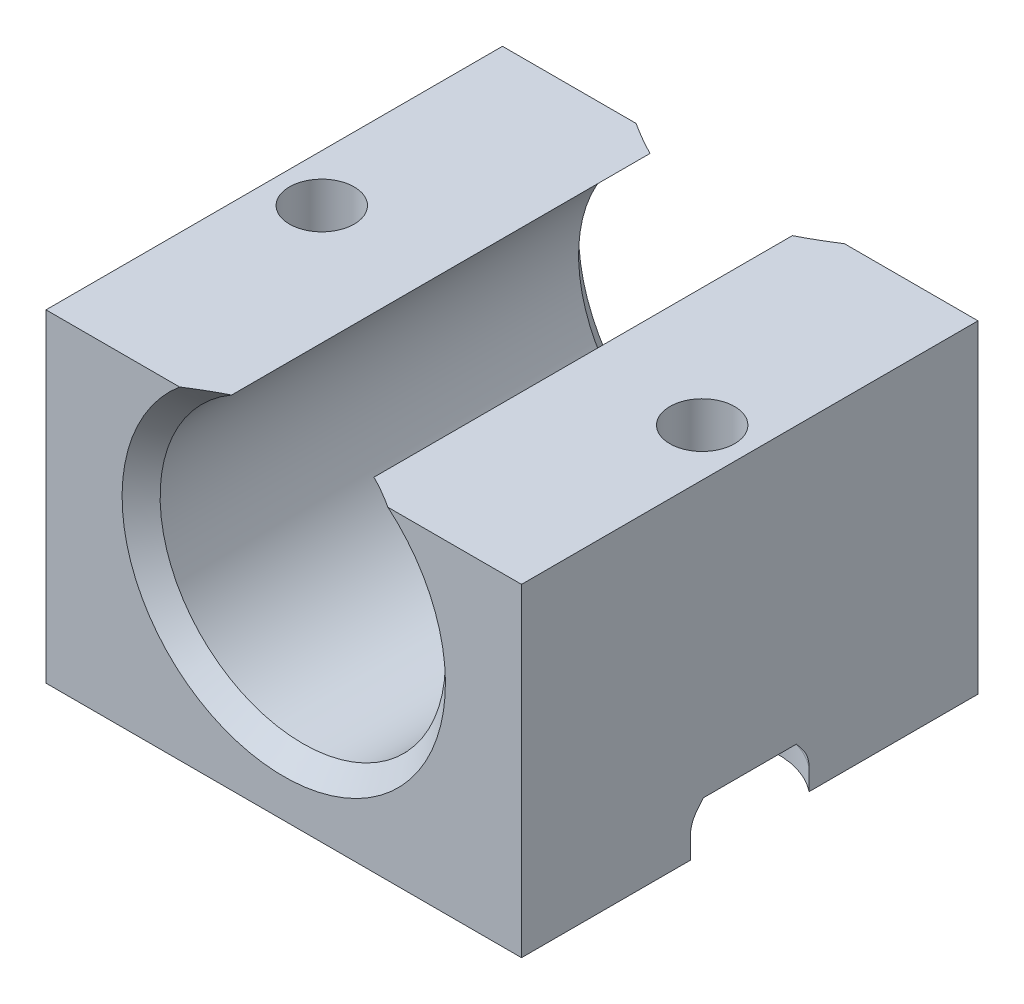
ISO-10303-21;
HEADER;
FILE_DESCRIPTION(('STEP AP214'),'2;1');
FILE_NAME('part.step','',(''),(''),'','','');
FILE_SCHEMA(('AUTOMOTIVE_DESIGN { 1 0 10303 214 1 1 1 1 }'));
ENDSEC;
DATA;
#1=APPLICATION_CONTEXT('core data for automotive mechanical design processes');
#2=APPLICATION_PROTOCOL_DEFINITION('international standard','automotive_design',2000,#1);
#3=PRODUCT_CONTEXT('',#1,'mechanical');
#4=PRODUCT('Part','Part','',(#3));
#5=PRODUCT_RELATED_PRODUCT_CATEGORY('part','',(#4));
#6=PRODUCT_DEFINITION_FORMATION('','',#4);
#7=PRODUCT_DEFINITION_CONTEXT('part definition',#1,'design');
#8=PRODUCT_DEFINITION('design','',#6,#7);
#9=PRODUCT_DEFINITION_SHAPE('','',#8);
#10=(LENGTH_UNIT() NAMED_UNIT(*) SI_UNIT(.MILLI.,.METRE.));
#11=(NAMED_UNIT(*) PLANE_ANGLE_UNIT() SI_UNIT($,.RADIAN.));
#12=(NAMED_UNIT(*) SI_UNIT($,.STERADIAN.) SOLID_ANGLE_UNIT());
#13=UNCERTAINTY_MEASURE_WITH_UNIT(LENGTH_MEASURE(1.E-05),#10,'distance_accuracy_value','');
#14=(GEOMETRIC_REPRESENTATION_CONTEXT(3) GLOBAL_UNCERTAINTY_ASSIGNED_CONTEXT((#13)) GLOBAL_UNIT_ASSIGNED_CONTEXT((#10,
#11,#12)) REPRESENTATION_CONTEXT('',''));
#15=CARTESIAN_POINT('',(0.,0.,0.));
#16=DIRECTION('',(0.,0.,1.));
#17=DIRECTION('',(1.,0.,0.));
#18=AXIS2_PLACEMENT_3D('',#15,#16,#17);
#19=CARTESIAN_POINT('',(22.5,17.,-12.));
#20=DIRECTION('',(0.,1.,0.));
#21=DIRECTION('',(0.,0.,1.));
#22=AXIS2_PLACEMENT_3D('',#19,#20,#21);
#23=CYLINDRICAL_SURFACE('',#22,1.69999999999999);
#24=CARTESIAN_POINT('',(22.5,17.,-12.));
#25=DIRECTION('',(0.,1.,0.));
#26=DIRECTION('',(0.,0.,1.));
#27=AXIS2_PLACEMENT_3D('',#24,#25,#26);
#28=CIRCLE('',#27,1.69999999999999);
#29=CARTESIAN_POINT('',(22.5,17.,-10.3));
#30=VERTEX_POINT('',#29);
#31=EDGE_CURVE('E349',#30,#30,#28,.T.);
#32=ORIENTED_EDGE('',*,*,#31,.T.);
#33=EDGE_LOOP('',(#32));
#34=FACE_BOUND('',#33,.T.);
#35=CARTESIAN_POINT('',(22.5,2.5,-12.));
#36=DIRECTION('',(0.,-1.,0.));
#37=DIRECTION('',(0.,0.,-1.));
#38=AXIS2_PLACEMENT_3D('',#35,#36,#37);
#39=CIRCLE('',#38,1.69999999999999);
#40=CARTESIAN_POINT('',(22.5,2.5,-13.7));
#41=VERTEX_POINT('',#40);
#42=EDGE_CURVE('E173',#41,#41,#39,.F.);
#43=ORIENTED_EDGE('',*,*,#42,.F.);
#44=EDGE_LOOP('',(#43));
#45=FACE_BOUND('',#44,.T.);
#46=ADVANCED_FACE('F35',(#34,#45),#23,.F.);
#47=CARTESIAN_POINT('',(2.5,17.,-12.));
#48=DIRECTION('',(0.,1.,0.));
#49=DIRECTION('',(0.,0.,1.));
#50=AXIS2_PLACEMENT_3D('',#47,#48,#49);
#51=CYLINDRICAL_SURFACE('',#50,1.69999999999999);
#52=CARTESIAN_POINT('',(2.5,17.,-12.));
#53=DIRECTION('',(0.,1.,0.));
#54=DIRECTION('',(0.,0.,1.));
#55=AXIS2_PLACEMENT_3D('',#52,#53,#54);
#56=CIRCLE('',#55,1.69999999999999);
#57=CARTESIAN_POINT('',(2.5,17.,-10.3));
#58=VERTEX_POINT('',#57);
#59=EDGE_CURVE('E183',#58,#58,#56,.T.);
#60=ORIENTED_EDGE('',*,*,#59,.T.);
#61=EDGE_LOOP('',(#60));
#62=FACE_BOUND('',#61,.T.);
#63=CARTESIAN_POINT('',(2.5,2.5,-12.));
#64=DIRECTION('',(0.,-1.,0.));
#65=DIRECTION('',(0.,0.,-1.));
#66=AXIS2_PLACEMENT_3D('',#63,#64,#65);
#67=CIRCLE('',#66,1.69999999999999);
#68=CARTESIAN_POINT('',(2.5,2.5,-13.7));
#69=VERTEX_POINT('',#68);
#70=EDGE_CURVE('E212',#69,#69,#67,.F.);
#71=ORIENTED_EDGE('',*,*,#70,.F.);
#72=EDGE_LOOP('',(#71));
#73=FACE_BOUND('',#72,.T.);
#74=ADVANCED_FACE('F411',(#62,#73),#51,.F.);
#75=CARTESIAN_POINT('',(0.,17.,0.));
#76=DIRECTION('',(0.,0.,-1.));
#77=DIRECTION('',(-1.,0.,0.));
#78=AXIS2_PLACEMENT_3D('',#75,#76,#77);
#79=PLANE('',#78);
#80=DIRECTION('',(1.,0.,0.));
#81=VECTOR('',#80,1.);
#82=CARTESIAN_POINT('',(0.,17.,0.));
#83=LINE('',#82,#81);
#84=CARTESIAN_POINT('',(17.9772255750517,17.,0.));
#85=VERTEX_POINT('',#84);
#86=CARTESIAN_POINT('',(25.,17.,0.));
#87=VERTEX_POINT('',#86);
#88=EDGE_CURVE('E192',#85,#87,#83,.T.);
#89=ORIENTED_EDGE('',*,*,#88,.F.);
#90=CARTESIAN_POINT('',(12.5,10.5,0.));
#91=DIRECTION('',(0.,0.,-1.));
#92=DIRECTION('',(-1.,0.,0.));
#93=AXIS2_PLACEMENT_3D('',#90,#91,#92);
#94=CIRCLE('',#93,8.5);
#95=CARTESIAN_POINT('',(7.02277442494833,17.,0.));
#96=VERTEX_POINT('',#95);
#97=EDGE_CURVE('E265',#85,#96,#94,.T.);
#98=ORIENTED_EDGE('',*,*,#97,.T.);
#99=CARTESIAN_POINT('',(0.,17.,0.));
#100=VERTEX_POINT('',#99);
#101=EDGE_CURVE('E354',#100,#96,#83,.T.);
#102=ORIENTED_EDGE('',*,*,#101,.F.);
#103=DIRECTION('',(0.,-1.,0.));
#104=VECTOR('',#103,1.);
#105=CARTESIAN_POINT('',(0.,17.,0.));
#106=LINE('',#105,#104);
#107=CARTESIAN_POINT('',(0.,0.,0.));
#108=VERTEX_POINT('',#107);
#109=EDGE_CURVE('E193',#100,#108,#106,.T.);
#110=ORIENTED_EDGE('',*,*,#109,.T.);
#111=DIRECTION('',(1.,0.,0.));
#112=VECTOR('',#111,1.);
#113=CARTESIAN_POINT('',(0.,0.,0.));
#114=LINE('',#113,#112);
#115=CARTESIAN_POINT('',(25.,0.,0.));
#116=VERTEX_POINT('',#115);
#117=EDGE_CURVE('E180',#108,#116,#114,.T.);
#118=ORIENTED_EDGE('',*,*,#117,.T.);
#119=DIRECTION('',(0.,-1.,0.));
#120=VECTOR('',#119,1.);
#121=CARTESIAN_POINT('',(25.,17.,0.));
#122=LINE('',#121,#120);
#123=EDGE_CURVE('E202',#87,#116,#122,.T.);
#124=ORIENTED_EDGE('',*,*,#123,.F.);
#125=EDGE_LOOP('',(#89,#98,#102,#110,#118,#124));
#126=FACE_BOUND('',#125,.T.);
#127=ADVANCED_FACE('F375',(#126),#79,.F.);
#128=CARTESIAN_POINT('',(0.,17.,-24.));
#129=DIRECTION('',(0.,0.,1.));
#130=DIRECTION('',(1.,0.,0.));
#131=AXIS2_PLACEMENT_3D('',#128,#129,#130);
#132=PLANE('',#131);
#133=DIRECTION('',(-1.,0.,0.));
#134=VECTOR('',#133,1.);
#135=CARTESIAN_POINT('',(0.,17.,-24.));
#136=LINE('',#135,#134);
#137=CARTESIAN_POINT('',(7.02277442494826,17.,-24.));
#138=VERTEX_POINT('',#137);
#139=CARTESIAN_POINT('',(0.,17.,-24.));
#140=VERTEX_POINT('',#139);
#141=EDGE_CURVE('E359',#138,#140,#136,.T.);
#142=ORIENTED_EDGE('',*,*,#141,.F.);
#143=CARTESIAN_POINT('',(12.5,10.5,-24.));
#144=DIRECTION('',(0.,0.,1.));
#145=DIRECTION('',(1.,0.,0.));
#146=AXIS2_PLACEMENT_3D('',#143,#144,#145);
#147=CIRCLE('',#146,8.50000000000005);
#148=CARTESIAN_POINT('',(17.9772255750517,17.,-24.));
#149=VERTEX_POINT('',#148);
#150=EDGE_CURVE('E260',#138,#149,#147,.T.);
#151=ORIENTED_EDGE('',*,*,#150,.T.);
#152=CARTESIAN_POINT('',(25.,17.,-24.));
#153=VERTEX_POINT('',#152);
#154=EDGE_CURVE('E360',#153,#149,#136,.T.);
#155=ORIENTED_EDGE('',*,*,#154,.F.);
#156=DIRECTION('',(0.,-1.,0.));
#157=VECTOR('',#156,1.);
#158=CARTESIAN_POINT('',(25.,17.,-24.));
#159=LINE('',#158,#157);
#160=CARTESIAN_POINT('',(25.,0.,-24.));
#161=VERTEX_POINT('',#160);
#162=EDGE_CURVE('E200',#153,#161,#159,.T.);
#163=ORIENTED_EDGE('',*,*,#162,.T.);
#164=DIRECTION('',(-1.,0.,0.));
#165=VECTOR('',#164,1.);
#166=CARTESIAN_POINT('',(0.,0.,-24.));
#167=LINE('',#166,#165);
#168=CARTESIAN_POINT('',(0.,0.,-24.));
#169=VERTEX_POINT('',#168);
#170=EDGE_CURVE('E178',#161,#169,#167,.T.);
#171=ORIENTED_EDGE('',*,*,#170,.T.);
#172=DIRECTION('',(0.,-1.,0.));
#173=VECTOR('',#172,1.);
#174=CARTESIAN_POINT('',(0.,17.,-24.));
#175=LINE('',#174,#173);
#176=EDGE_CURVE('E196',#140,#169,#175,.T.);
#177=ORIENTED_EDGE('',*,*,#176,.F.);
#178=EDGE_LOOP('',(#142,#151,#155,#163,#171,#177));
#179=FACE_BOUND('',#178,.T.);
#180=ADVANCED_FACE('F287',(#179),#132,.F.);
#181=CARTESIAN_POINT('',(0.,17.,0.));
#182=DIRECTION('',(0.,1.,0.));
#183=DIRECTION('',(0.,0.,1.));
#184=AXIS2_PLACEMENT_3D('',#181,#182,#183);
#185=PLANE('',#184);
#186=ORIENTED_EDGE('',*,*,#31,.F.);
#187=EDGE_LOOP('',(#186));
#188=FACE_BOUND('',#187,.T.);
#189=ORIENTED_EDGE('',*,*,#154,.T.);
#190=CARTESIAN_POINT('',(17.9772255750517,17.,-24.));
#191=CARTESIAN_POINT('',(17.8368007577669,17.,-23.9095295769993));
#192=CARTESIAN_POINT('',(17.6954537894629,17.,-23.8204671646845));
#193=CARTESIAN_POINT('',(17.4108110965804,17.,-23.6457585728799));
#194=CARTESIAN_POINT('',(17.2675168959503,17.,-23.5601099073508));
#195=CARTESIAN_POINT('',(16.9786465410307,17.,-23.3926810177934));
#196=CARTESIAN_POINT('',(16.8330700586579,17.,-23.3109013568598));
#197=CARTESIAN_POINT('',(16.5393318554942,17.,-23.1518640466128));
#198=CARTESIAN_POINT('',(16.391168293193,17.,-23.0746098043457));
#199=CARTESIAN_POINT('',(16.2416573867739,17.,-23.));
#200=B_SPLINE_CURVE_WITH_KNOTS('',3,(#190,#191,#192,#193,#194,#195,#196,#197,#198,#199),
.UNSPECIFIED.,.F.,.F.,(4,2,2,2,4),(0.,0.50114453227682,1.00191718035662,1.50276248805595,
2.00398014441625),.UNSPECIFIED.);
#201=CARTESIAN_POINT('',(16.2416573867739,17.,-23.));
#202=VERTEX_POINT('',#201);
#203=EDGE_CURVE('E259',#149,#202,#200,.T.);
#204=ORIENTED_EDGE('',*,*,#203,.T.);
#205=DIRECTION('',(0.,0.,-1.));
#206=VECTOR('',#205,1.);
#207=CARTESIAN_POINT('',(16.2416573867739,17.,48.250647664047));
#208=LINE('',#207,#206);
#209=CARTESIAN_POINT('',(16.2416573867739,17.,-1.));
#210=VERTEX_POINT('',#209);
#211=EDGE_CURVE('E208',#202,#210,#208,.F.);
#212=ORIENTED_EDGE('',*,*,#211,.T.);
#213=CARTESIAN_POINT('',(16.2416573867739,17.,-1.));
#214=CARTESIAN_POINT('',(16.391168293193,17.,-0.925390195654238));
#215=CARTESIAN_POINT('',(16.5393318554942,17.,-0.848135953387118));
#216=CARTESIAN_POINT('',(16.8330700586579,17.,-0.689098643140127));
#217=CARTESIAN_POINT('',(16.9786465410307,17.,-0.607318982206532));
#218=CARTESIAN_POINT('',(17.2675168959502,17.,-0.439890092649158));
#219=CARTESIAN_POINT('',(17.4108110965804,17.,-0.354241427120119));
#220=CARTESIAN_POINT('',(17.6954537894628,17.,-0.179532835315521));
#221=CARTESIAN_POINT('',(17.8368007577668,17.,-0.090470423000706));
#222=CARTESIAN_POINT('',(17.9772255750517,17.,0.));
#223=B_SPLINE_CURVE_WITH_KNOTS('',3,(#213,#214,#215,#216,#217,#218,#219,#220,#221,#222),
.UNSPECIFIED.,.F.,.F.,(4,2,2,2,4),(0.,0.501217656360276,1.00206296405958,1.50283561213936,
2.00398014441616),.UNSPECIFIED.);
#224=EDGE_CURVE('E254',#210,#85,#223,.T.);
#225=ORIENTED_EDGE('',*,*,#224,.T.);
#226=ORIENTED_EDGE('',*,*,#88,.T.);
#227=DIRECTION('',(0.,0.,-1.));
#228=VECTOR('',#227,1.);
#229=CARTESIAN_POINT('',(25.,17.,0.));
#230=LINE('',#229,#228);
#231=EDGE_CURVE('E357',#87,#153,#230,.T.);
#232=ORIENTED_EDGE('',*,*,#231,.T.);
#233=EDGE_LOOP('',(#189,#204,#212,#225,#226,#232));
#234=FACE_BOUND('',#233,.T.);
#235=ADVANCED_FACE('F237',(#188,#234),#185,.T.);
#236=ORIENTED_EDGE('',*,*,#59,.F.);
#237=EDGE_LOOP('',(#236));
#238=FACE_BOUND('',#237,.T.);
#239=DIRECTION('',(0.,0.,-1.));
#240=VECTOR('',#239,1.);
#241=CARTESIAN_POINT('',(8.75834261322606,17.,48.250647664047));
#242=LINE('',#241,#240);
#243=CARTESIAN_POINT('',(8.75834261322606,17.,-1.));
#244=VERTEX_POINT('',#243);
#245=CARTESIAN_POINT('',(8.75834261322606,17.,-23.));
#246=VERTEX_POINT('',#245);
#247=EDGE_CURVE('E205',#244,#246,#242,.T.);
#248=ORIENTED_EDGE('',*,*,#247,.T.);
#249=CARTESIAN_POINT('',(8.75834261322606,17.,-23.));
#250=CARTESIAN_POINT('',(8.60883170680697,17.,-23.0746098043457));
#251=CARTESIAN_POINT('',(8.46066814450583,17.,-23.1518640466128));
#252=CARTESIAN_POINT('',(8.16692994134206,17.,-23.3109013568598));
#253=CARTESIAN_POINT('',(8.02135345896928,17.,-23.3926810177934));
#254=CARTESIAN_POINT('',(7.73248310404975,17.,-23.5601099073508));
#255=CARTESIAN_POINT('',(7.58918890341958,17.,-23.6457585728799));
#256=CARTESIAN_POINT('',(7.30454621053715,17.,-23.8204671646845));
#257=CARTESIAN_POINT('',(7.16319924223313,17.,-23.9095295769993));
#258=CARTESIAN_POINT('',(7.02277442494827,17.,-24.));
#259=B_SPLINE_CURVE_WITH_KNOTS('',3,(#249,#250,#251,#252,#253,#254,#255,#256,#257,#258),
.UNSPECIFIED.,.F.,.F.,(4,2,2,2,4),(0.,0.5012176563603,1.00206296405963,1.50283561213943,
2.00398014441625),.UNSPECIFIED.);
#260=EDGE_CURVE('E231',#246,#138,#259,.T.);
#261=ORIENTED_EDGE('',*,*,#260,.T.);
#262=ORIENTED_EDGE('',*,*,#141,.T.);
#263=DIRECTION('',(0.,0.,1.));
#264=VECTOR('',#263,1.);
#265=CARTESIAN_POINT('',(0.,17.,0.));
#266=LINE('',#265,#264);
#267=EDGE_CURVE('E197',#140,#100,#266,.T.);
#268=ORIENTED_EDGE('',*,*,#267,.T.);
#269=ORIENTED_EDGE('',*,*,#101,.T.);
#270=CARTESIAN_POINT('',(7.02277442494833,17.,0.));
#271=CARTESIAN_POINT('',(7.1631992422332,17.,-0.0904704230007053));
#272=CARTESIAN_POINT('',(7.3045462105372,17.,-0.179532835315519));
#273=CARTESIAN_POINT('',(7.58918890341963,17.,-0.354241427120116));
#274=CARTESIAN_POINT('',(7.73248310404979,17.,-0.439890092649156));
#275=CARTESIAN_POINT('',(8.02135345896931,17.,-0.60731898220653));
#276=CARTESIAN_POINT('',(8.16692994134208,17.,-0.689098643140126));
#277=CARTESIAN_POINT('',(8.46066814450584,17.,-0.848135953387118));
#278=CARTESIAN_POINT('',(8.60883170680697,17.,-0.925390195654238));
#279=CARTESIAN_POINT('',(8.75834261322606,17.,-1.));
#280=B_SPLINE_CURVE_WITH_KNOTS('',3,(#270,#271,#272,#273,#274,#275,#276,#277,#278,#279),
.UNSPECIFIED.,.F.,.F.,(4,2,2,2,4),(0.,0.501144532276793,1.00191718035658,1.50276248805589,
2.00398014441616),.UNSPECIFIED.);
#281=EDGE_CURVE('E224',#96,#244,#280,.T.);
#282=ORIENTED_EDGE('',*,*,#281,.T.);
#283=EDGE_LOOP('',(#248,#261,#262,#268,#269,#282));
#284=FACE_BOUND('',#283,.T.);
#285=ADVANCED_FACE('F365',(#238,#284),#185,.T.);
#286=CARTESIAN_POINT('',(25.,17.,0.));
#287=DIRECTION('',(-1.,0.,0.));
#288=DIRECTION('',(0.,0.,1.));
#289=AXIS2_PLACEMENT_3D('',#286,#287,#288);
#290=PLANE('',#289);
#291=DIRECTION('',(0.,0.,1.));
#292=VECTOR('',#291,1.);
#293=CARTESIAN_POINT('',(25.,2.5,0.));
#294=LINE('',#293,#292);
#295=CARTESIAN_POINT('',(25.,2.5,-14.4494897427832));
#296=VERTEX_POINT('',#295);
#297=CARTESIAN_POINT('',(25.,2.5,-9.55051025721683));
#298=VERTEX_POINT('',#297);
#299=EDGE_CURVE('E218',#296,#298,#294,.T.);
#300=ORIENTED_EDGE('',*,*,#299,.F.);
#301=CARTESIAN_POINT('',(25.,2.5,-14.4494897427832));
#302=CARTESIAN_POINT('',(25.,2.4294733356692,-14.50766035782));
#303=CARTESIAN_POINT('',(25.,2.35844129345759,-14.5652126943565));
#304=CARTESIAN_POINT('',(25.,2.21552351405223,-14.6792227808208));
#305=CARTESIAN_POINT('',(25.,2.14363792619725,-14.7356807178066));
#306=CARTESIAN_POINT('',(25.,1.99914828070791,-14.847661927474));
#307=CARTESIAN_POINT('',(25.,1.92654424892279,-14.9031852335904));
#308=CARTESIAN_POINT('',(25.,1.78070461222063,-15.0134228784778));
#309=CARTESIAN_POINT('',(25.,1.70746890069387,-15.0681370762904));
#310=CARTESIAN_POINT('',(25.,1.63397459621554,-15.1224989991992));
#311=B_SPLINE_CURVE_WITH_KNOTS('',3,(#301,#302,#303,#304,#305,#306,#307,#308,#309,#310),
.UNSPECIFIED.,.F.,.F.,(4,2,2,2,4),(0.,0.274254954675618,0.548462612010212,0.822660439116235,
1.09690548568772),.UNSPECIFIED.);
#312=CARTESIAN_POINT('',(25.,2.09807621135342,-14.7709570964337));
#313=VERTEX_POINT('',#312);
#314=EDGE_CURVE('E316',#296,#313,#311,.T.);
#315=ORIENTED_EDGE('',*,*,#314,.T.);
#316=CARTESIAN_POINT('',(25.,2.0980762113533,-14.7709570964336));
#317=CARTESIAN_POINT('',(25.,2.06129315486059,-14.7995620088444));
#318=CARTESIAN_POINT('',(25.,2.02339987139945,-14.8267206651427));
#319=CARTESIAN_POINT('',(25.,1.94553620900424,-14.8779117492824));
#320=CARTESIAN_POINT('',(25.,1.90556495606886,-14.9019428465277));
#321=CARTESIAN_POINT('',(25.,1.78512104477124,-14.9676909862766));
#322=CARTESIAN_POINT('',(25.,1.70200790830729,-15.0047099476673));
#323=CARTESIAN_POINT('',(25.,1.53430717359765,-15.0630092048468));
#324=CARTESIAN_POINT('',(25.,1.44992672103152,-15.0848831378633));
#325=CARTESIAN_POINT('',(25.,1.32042809370499,-15.1072410963697));
#326=CARTESIAN_POINT('',(25.,1.27616359456969,-15.1129540956259));
#327=CARTESIAN_POINT('',(25.,1.1872979666383,-15.1205851637684));
#328=CARTESIAN_POINT('',(25.,1.14269675770173,-15.1225022986561));
#329=CARTESIAN_POINT('',(25.,1.09807621135331,-15.1224989991992));
#330=B_SPLINE_CURVE_WITH_KNOTS('',3,(#316,#317,#318,#319,#320,#321,#322,#323,#324,#325,#326,
#327,#328,#329),.UNSPECIFIED.,.F.,.F.,(4,2,2,2,2,2,4),(0.,0.139726029972452,0.279511312330738,
0.551145966164611,0.811416794455069,0.945166682001691,1.07894947554622),.UNSPECIFIED.);
#331=CARTESIAN_POINT('',(25.,1.09807621135331,-15.1224989991992));
#332=VERTEX_POINT('',#331);
#333=EDGE_CURVE('E160',#313,#332,#330,.T.);
#334=ORIENTED_EDGE('',*,*,#333,.T.);
#335=DIRECTION('',(0.,-1.,0.));
#336=VECTOR('',#335,1.);
#337=CARTESIAN_POINT('',(25.,2.5,-15.1224989991992));
#338=LINE('',#337,#336);
#339=CARTESIAN_POINT('',(25.,0.,-15.1224989991992));
#340=VERTEX_POINT('',#339);
#341=EDGE_CURVE('E150',#332,#340,#338,.T.);
#342=ORIENTED_EDGE('',*,*,#341,.T.);
#343=DIRECTION('',(0.,0.,-1.));
#344=VECTOR('',#343,1.);
#345=CARTESIAN_POINT('',(25.,0.,0.));
#346=LINE('',#345,#344);
#347=EDGE_CURVE('E156',#340,#161,#346,.T.);
#348=ORIENTED_EDGE('',*,*,#347,.T.);
#349=ORIENTED_EDGE('',*,*,#162,.F.);
#350=ORIENTED_EDGE('',*,*,#231,.F.);
#351=ORIENTED_EDGE('',*,*,#123,.T.);
#352=CARTESIAN_POINT('',(25.,0.,-8.8775010008008));
#353=VERTEX_POINT('',#352);
#354=EDGE_CURVE('E179',#116,#353,#346,.T.);
#355=ORIENTED_EDGE('',*,*,#354,.T.);
#356=DIRECTION('',(0.,-1.,0.));
#357=VECTOR('',#356,1.);
#358=CARTESIAN_POINT('',(25.,2.5,-8.8775010008008));
#359=LINE('',#358,#357);
#360=CARTESIAN_POINT('',(25.,1.09807621135331,-8.8775010008008));
#361=VERTEX_POINT('',#360);
#362=EDGE_CURVE('E165',#353,#361,#359,.F.);
#363=ORIENTED_EDGE('',*,*,#362,.T.);
#364=CARTESIAN_POINT('',(25.,1.09807621135331,-8.8775010008008));
#365=CARTESIAN_POINT('',(25.,1.14459996288281,-8.87749765353823));
#366=CARTESIAN_POINT('',(25.,1.19110052417221,-8.87958186907263));
#367=CARTESIAN_POINT('',(25.,1.28372123385488,-8.88787512246337));
#368=CARTESIAN_POINT('',(25.,1.32984147217708,-8.89408315516168));
#369=CARTESIAN_POINT('',(25.,1.46459094832764,-8.91835544083346));
#370=CARTESIAN_POINT('',(25.,1.55225966992536,-8.94207973238618));
#371=CARTESIAN_POINT('',(25.,1.71914868188715,-9.00267511231386));
#372=CARTESIAN_POINT('',(25.,1.79856262880603,-9.03901883812001));
#373=CARTESIAN_POINT('',(25.,1.91374357309116,-9.1029120155424));
#374=CARTESIAN_POINT('',(25.,1.95196435644742,-9.12615015430528));
#375=CARTESIAN_POINT('',(25.,2.02648940832072,-9.17549708009296));
#376=CARTESIAN_POINT('',(25.,2.06279429053835,-9.20160493952728));
#377=CARTESIAN_POINT('',(25.,2.0980762113533,-9.22904290356643));
#378=B_SPLINE_CURVE_WITH_KNOTS('',3,(#364,#365,#366,#367,#368,#369,#370,#371,#372,#373,#374,
#375,#376,#377),.UNSPECIFIED.,.F.,.F.,(4,2,2,2,2,2,4),(0.,0.139479425151139,0.278924865419262,
0.549974274335852,0.810841256409603,0.944916193747439,1.07894792028271),.UNSPECIFIED.);
#379=CARTESIAN_POINT('',(25.,2.09807621135342,-9.22904290356628));
#380=VERTEX_POINT('',#379);
#381=EDGE_CURVE('E300',#361,#380,#378,.T.);
#382=ORIENTED_EDGE('',*,*,#381,.T.);
#383=CARTESIAN_POINT('',(25.,1.63397459621554,-8.8775010008008));
#384=CARTESIAN_POINT('',(25.,1.70746890069387,-8.93186292370959));
#385=CARTESIAN_POINT('',(25.,1.78070461222063,-8.9865771215222));
#386=CARTESIAN_POINT('',(25.,1.92654424892279,-9.09681476640963));
#387=CARTESIAN_POINT('',(25.,1.99914828070791,-9.15233807252599));
#388=CARTESIAN_POINT('',(25.,2.14363792619725,-9.26431928219337));
#389=CARTESIAN_POINT('',(25.,2.21552351405223,-9.32077721917915));
#390=CARTESIAN_POINT('',(25.,2.35844129345759,-9.43478730564347));
#391=CARTESIAN_POINT('',(25.,2.4294733356692,-9.49233964218004));
#392=CARTESIAN_POINT('',(25.,2.5,-9.55051025721683));
#393=B_SPLINE_CURVE_WITH_KNOTS('',3,(#383,#384,#385,#386,#387,#388,#389,#390,#391,#392),
.UNSPECIFIED.,.F.,.F.,(4,2,2,2,4),(0.,0.274245046571481,0.548442873677505,0.822650531012097,
1.09690548568772),.UNSPECIFIED.);
#394=EDGE_CURVE('E321',#380,#298,#393,.T.);
#395=ORIENTED_EDGE('',*,*,#394,.T.);
#396=EDGE_LOOP('',(#300,#315,#334,#342,#348,#349,#350,#351,#355,#363,#382,#395));
#397=FACE_BOUND('',#396,.T.);
#398=ADVANCED_FACE('F153',(#397),#290,.F.);
#399=CARTESIAN_POINT('',(0.,17.,0.));
#400=DIRECTION('',(1.,0.,0.));
#401=DIRECTION('',(0.,0.,-1.));
#402=AXIS2_PLACEMENT_3D('',#399,#400,#401);
#403=PLANE('',#402);
#404=DIRECTION('',(0.,0.,-1.));
#405=VECTOR('',#404,1.);
#406=CARTESIAN_POINT('',(0.,2.5,0.));
#407=LINE('',#406,#405);
#408=CARTESIAN_POINT('',(0.,2.5,-9.55051025721681));
#409=VERTEX_POINT('',#408);
#410=CARTESIAN_POINT('',(0.,2.5,-14.4494897427832));
#411=VERTEX_POINT('',#410);
#412=EDGE_CURVE('E215',#409,#411,#407,.T.);
#413=ORIENTED_EDGE('',*,*,#412,.F.);
#414=CARTESIAN_POINT('',(0.,2.5,-9.55051025721681));
#415=CARTESIAN_POINT('',(0.,2.4294733356692,-9.49233964218002));
#416=CARTESIAN_POINT('',(0.,2.3584412934576,-9.43478730564346));
#417=CARTESIAN_POINT('',(0.,2.21552351405224,-9.32077721917914));
#418=CARTESIAN_POINT('',(0.,2.14363792619725,-9.26431928219336));
#419=CARTESIAN_POINT('',(0.,1.99914828070792,-9.15233807252598));
#420=CARTESIAN_POINT('',(0.,1.9265442489228,-9.09681476640962));
#421=CARTESIAN_POINT('',(0.,1.78070461222065,-8.9865771215222));
#422=CARTESIAN_POINT('',(0.,1.70746890069389,-8.93186292370959));
#423=CARTESIAN_POINT('',(0.,1.63397459621556,-8.8775010008008));
#424=B_SPLINE_CURVE_WITH_KNOTS('',3,(#414,#415,#416,#417,#418,#419,#420,#421,#422,#423),
.UNSPECIFIED.,.F.,.F.,(4,2,2,2,4),(0.,0.274254954675611,0.548462612010198,0.822660439116215,
1.09690548568769),.UNSPECIFIED.);
#425=CARTESIAN_POINT('',(0.,2.09807621135343,-9.22904290356628));
#426=VERTEX_POINT('',#425);
#427=EDGE_CURVE('E273',#409,#426,#424,.T.);
#428=ORIENTED_EDGE('',*,*,#427,.T.);
#429=CARTESIAN_POINT('',(0.,2.09807621135331,-9.22904290356643));
#430=CARTESIAN_POINT('',(0.,2.0612931548606,-9.20043799115563));
#431=CARTESIAN_POINT('',(0.,2.02339987139946,-9.17327933485727));
#432=CARTESIAN_POINT('',(0.,1.94553620900425,-9.12208825071761));
#433=CARTESIAN_POINT('',(0.,1.90556495606888,-9.09805715347234));
#434=CARTESIAN_POINT('',(0.,1.78512104477126,-9.0323090137234));
#435=CARTESIAN_POINT('',(0.,1.7020079083073,-8.99529005233267));
#436=CARTESIAN_POINT('',(0.,1.53430717359766,-8.93699079515322));
#437=CARTESIAN_POINT('',(0.,1.44992672103154,-8.91511686213665));
#438=CARTESIAN_POINT('',(0.,1.320428093705,-8.89275890363025));
#439=CARTESIAN_POINT('',(0.,1.2761635945697,-8.88704590437413));
#440=CARTESIAN_POINT('',(0.,1.18729796663831,-8.87941483623158));
#441=CARTESIAN_POINT('',(0.,1.14269675770174,-8.87749770134386));
#442=CARTESIAN_POINT('',(0.,1.09807621135333,-8.8775010008008));
#443=B_SPLINE_CURVE_WITH_KNOTS('',3,(#429,#430,#431,#432,#433,#434,#435,#436,#437,#438,#439,
#440,#441,#442),.UNSPECIFIED.,.F.,.F.,(4,2,2,2,2,2,4),(0.,0.139726029972452,0.279511312330737,
0.55114596616461,0.811416794455069,0.94516668200169,1.07894947554622),.UNSPECIFIED.);
#444=CARTESIAN_POINT('',(0.,1.09807621135333,-8.8775010008008));
#445=VERTEX_POINT('',#444);
#446=EDGE_CURVE('E11',#426,#445,#443,.T.);
#447=ORIENTED_EDGE('',*,*,#446,.T.);
#448=DIRECTION('',(0.,-1.,0.));
#449=VECTOR('',#448,1.);
#450=CARTESIAN_POINT('',(0.,2.5,-8.8775010008008));
#451=LINE('',#450,#449);
#452=CARTESIAN_POINT('',(0.,0.,-8.8775010008008));
#453=VERTEX_POINT('',#452);
#454=EDGE_CURVE('E347',#445,#453,#451,.T.);
#455=ORIENTED_EDGE('',*,*,#454,.T.);
#456=DIRECTION('',(0.,0.,1.));
#457=VECTOR('',#456,1.);
#458=CARTESIAN_POINT('',(0.,0.,0.));
#459=LINE('',#458,#457);
#460=EDGE_CURVE('E188',#453,#108,#459,.T.);
#461=ORIENTED_EDGE('',*,*,#460,.T.);
#462=ORIENTED_EDGE('',*,*,#109,.F.);
#463=ORIENTED_EDGE('',*,*,#267,.F.);
#464=ORIENTED_EDGE('',*,*,#176,.T.);
#465=CARTESIAN_POINT('',(0.,0.,-15.1224989991992));
#466=VERTEX_POINT('',#465);
#467=EDGE_CURVE('E189',#169,#466,#459,.T.);
#468=ORIENTED_EDGE('',*,*,#467,.T.);
#469=DIRECTION('',(0.,-1.,0.));
#470=VECTOR('',#469,1.);
#471=CARTESIAN_POINT('',(0.,2.5,-15.1224989991992));
#472=LINE('',#471,#470);
#473=CARTESIAN_POINT('',(0.,1.09807621135333,-15.1224989991992));
#474=VERTEX_POINT('',#473);
#475=EDGE_CURVE('E345',#466,#474,#472,.F.);
#476=ORIENTED_EDGE('',*,*,#475,.T.);
#477=CARTESIAN_POINT('',(0.,1.09807621135333,-15.1224989991992));
#478=CARTESIAN_POINT('',(0.,1.14459996288282,-15.1225023464618));
#479=CARTESIAN_POINT('',(0.,1.19110052417223,-15.1204181309274));
#480=CARTESIAN_POINT('',(0.,1.28372123385489,-15.1121248775366));
#481=CARTESIAN_POINT('',(0.,1.32984147217709,-15.1059168448383));
#482=CARTESIAN_POINT('',(0.,1.46459094832765,-15.0816445591665));
#483=CARTESIAN_POINT('',(0.,1.55225966992537,-15.0579202676138));
#484=CARTESIAN_POINT('',(0.,1.71914868188716,-14.9973248876861));
#485=CARTESIAN_POINT('',(0.,1.79856262880604,-14.96098116188));
#486=CARTESIAN_POINT('',(0.,1.91374357309117,-14.8970879844576));
#487=CARTESIAN_POINT('',(0.,1.95196435644744,-14.8738498456947));
#488=CARTESIAN_POINT('',(0.,2.02648940832073,-14.824502919907));
#489=CARTESIAN_POINT('',(0.,2.06279429053836,-14.7983950604727));
#490=CARTESIAN_POINT('',(0.,2.09807621135331,-14.7709570964336));
#491=B_SPLINE_CURVE_WITH_KNOTS('',3,(#477,#478,#479,#480,#481,#482,#483,#484,#485,#486,#487,
#488,#489,#490),.UNSPECIFIED.,.F.,.F.,(4,2,2,2,2,2,4),(0.,0.139479425151139,0.278924865419262,
0.549974274335852,0.810841256409602,0.94491619374744,1.07894792028271),.UNSPECIFIED.);
#492=CARTESIAN_POINT('',(0.,2.09807621135343,-14.7709570964337));
#493=VERTEX_POINT('',#492);
#494=EDGE_CURVE('E48',#474,#493,#491,.T.);
#495=ORIENTED_EDGE('',*,*,#494,.T.);
#496=CARTESIAN_POINT('',(0.,1.63397459621556,-15.1224989991992));
#497=CARTESIAN_POINT('',(0.,1.70746890069389,-15.0681370762904));
#498=CARTESIAN_POINT('',(0.,1.78070461222065,-15.0134228784778));
#499=CARTESIAN_POINT('',(0.,1.9265442489228,-14.9031852335904));
#500=CARTESIAN_POINT('',(0.,1.99914828070792,-14.847661927474));
#501=CARTESIAN_POINT('',(0.,2.14363792619725,-14.7356807178066));
#502=CARTESIAN_POINT('',(0.,2.21552351405224,-14.6792227808209));
#503=CARTESIAN_POINT('',(0.,2.3584412934576,-14.5652126943565));
#504=CARTESIAN_POINT('',(0.,2.4294733356692,-14.50766035782));
#505=CARTESIAN_POINT('',(0.,2.5,-14.4494897427832));
#506=B_SPLINE_CURVE_WITH_KNOTS('',3,(#496,#497,#498,#499,#500,#501,#502,#503,#504,#505),
.UNSPECIFIED.,.F.,.F.,(4,2,2,2,4),(0.,0.274245046571475,0.548442873677492,0.822650531012078,
1.09690548568769),.UNSPECIFIED.);
#507=EDGE_CURVE('E278',#493,#411,#506,.T.);
#508=ORIENTED_EDGE('',*,*,#507,.T.);
#509=EDGE_LOOP('',(#413,#428,#447,#455,#461,#462,#463,#464,#468,#476,#495,#508));
#510=FACE_BOUND('',#509,.T.);
#511=ADVANCED_FACE('F283',(#510),#403,.F.);
#512=CARTESIAN_POINT('',(0.,0.,0.));
#513=DIRECTION('',(0.,1.,0.));
#514=DIRECTION('',(0.,0.,1.));
#515=AXIS2_PLACEMENT_3D('',#512,#513,#514);
#516=PLANE('',#515);
#517=ORIENTED_EDGE('',*,*,#347,.F.);
#518=CARTESIAN_POINT('',(22.5,0.,-12.));
#519=DIRECTION('',(0.,-1.,0.));
#520=DIRECTION('',(0.,0.,-1.));
#521=AXIS2_PLACEMENT_3D('',#518,#519,#520);
#522=CIRCLE('',#521,4.);
#523=EDGE_CURVE('E168',#353,#340,#522,.T.);
#524=ORIENTED_EDGE('',*,*,#523,.F.);
#525=ORIENTED_EDGE('',*,*,#354,.F.);
#526=ORIENTED_EDGE('',*,*,#117,.F.);
#527=ORIENTED_EDGE('',*,*,#460,.F.);
#528=CARTESIAN_POINT('',(2.5,0.,-12.));
#529=DIRECTION('',(0.,-1.,0.));
#530=DIRECTION('',(0.,0.,-1.));
#531=AXIS2_PLACEMENT_3D('',#528,#529,#530);
#532=CIRCLE('',#531,4.);
#533=EDGE_CURVE('E164',#466,#453,#532,.T.);
#534=ORIENTED_EDGE('',*,*,#533,.F.);
#535=ORIENTED_EDGE('',*,*,#467,.F.);
#536=ORIENTED_EDGE('',*,*,#170,.F.);
#537=EDGE_LOOP('',(#517,#524,#525,#526,#527,#534,#535,#536));
#538=FACE_BOUND('',#537,.T.);
#539=ADVANCED_FACE('F176',(#538),#516,.F.);
#540=CARTESIAN_POINT('',(12.5,10.5,48.250647664047));
#541=DIRECTION('',(0.,0.,-1.));
#542=DIRECTION('',(-1.,0.,0.));
#543=AXIS2_PLACEMENT_3D('',#540,#541,#542);
#544=CYLINDRICAL_SURFACE('',#543,7.5);
#545=ORIENTED_EDGE('',*,*,#211,.F.);
#546=CARTESIAN_POINT('',(12.5,10.5,-23.));
#547=DIRECTION('',(0.,0.,1.));
#548=DIRECTION('',(1.,0.,0.));
#549=AXIS2_PLACEMENT_3D('',#546,#547,#548);
#550=CIRCLE('',#549,7.5);
#551=EDGE_CURVE('E221',#202,#246,#550,.F.);
#552=ORIENTED_EDGE('',*,*,#551,.T.);
#553=ORIENTED_EDGE('',*,*,#247,.F.);
#554=CARTESIAN_POINT('',(12.5,10.5,-1.));
#555=DIRECTION('',(0.,0.,-1.));
#556=DIRECTION('',(-1.,0.,0.));
#557=AXIS2_PLACEMENT_3D('',#554,#555,#556);
#558=CIRCLE('',#557,7.5);
#559=EDGE_CURVE('E211',#244,#210,#558,.F.);
#560=ORIENTED_EDGE('',*,*,#559,.T.);
#561=EDGE_LOOP('',(#545,#552,#553,#560));
#562=FACE_BOUND('',#561,.T.);
#563=ADVANCED_FACE('F382',(#562),#544,.F.);
#564=CARTESIAN_POINT('',(2.5,2.5,-12.));
#565=DIRECTION('',(0.,-1.,0.));
#566=DIRECTION('',(0.,0.,-1.));
#567=AXIS2_PLACEMENT_3D('',#564,#565,#566);
#568=CYLINDRICAL_SURFACE('',#567,4.);
#569=ORIENTED_EDGE('',*,*,#454,.F.);
#570=CARTESIAN_POINT('',(2.5,1.09807621135333,-12.));
#571=DIRECTION('',(0.,1.,0.));
#572=DIRECTION('',(0.,0.,1.));
#573=AXIS2_PLACEMENT_3D('',#570,#571,#572);
#574=CIRCLE('',#573,4.);
#575=EDGE_CURVE('E330',#445,#474,#574,.T.);
#576=ORIENTED_EDGE('',*,*,#575,.T.);
#577=ORIENTED_EDGE('',*,*,#475,.F.);
#578=ORIENTED_EDGE('',*,*,#533,.T.);
#579=EDGE_LOOP('',(#569,#576,#577,#578));
#580=FACE_BOUND('',#579,.T.);
#581=ADVANCED_FACE('F394',(#580),#568,.F.);
#582=CARTESIAN_POINT('',(2.5,2.5,-12.));
#583=DIRECTION('',(0.,-1.,0.));
#584=DIRECTION('',(0.,0.,-1.));
#585=AXIS2_PLACEMENT_3D('',#582,#583,#584);
#586=PLANE('',#585);
#587=ORIENTED_EDGE('',*,*,#70,.T.);
#588=EDGE_LOOP('',(#587));
#589=FACE_BOUND('',#588,.T.);
#590=ORIENTED_EDGE('',*,*,#412,.T.);
#591=CARTESIAN_POINT('',(2.5,2.5,-12.));
#592=DIRECTION('',(0.,-1.,0.));
#593=DIRECTION('',(0.,0.,-1.));
#594=AXIS2_PLACEMENT_3D('',#591,#592,#593);
#595=CIRCLE('',#594,3.50000000000001);
#596=EDGE_CURVE('E267',#411,#409,#595,.T.);
#597=ORIENTED_EDGE('',*,*,#596,.T.);
#598=EDGE_LOOP('',(#590,#597));
#599=FACE_BOUND('',#598,.T.);
#600=ADVANCED_FACE('F400',(#589,#599),#586,.T.);
#601=CARTESIAN_POINT('',(22.5,2.5,-12.));
#602=DIRECTION('',(0.,-1.,0.));
#603=DIRECTION('',(0.,0.,-1.));
#604=AXIS2_PLACEMENT_3D('',#601,#602,#603);
#605=CYLINDRICAL_SURFACE('',#604,4.);
#606=ORIENTED_EDGE('',*,*,#341,.F.);
#607=CARTESIAN_POINT('',(22.5,1.09807621135331,-12.));
#608=DIRECTION('',(0.,1.,0.));
#609=DIRECTION('',(0.,0.,1.));
#610=AXIS2_PLACEMENT_3D('',#607,#608,#609);
#611=CIRCLE('',#610,4.);
#612=EDGE_CURVE('E326',#332,#361,#611,.T.);
#613=ORIENTED_EDGE('',*,*,#612,.T.);
#614=ORIENTED_EDGE('',*,*,#362,.F.);
#615=ORIENTED_EDGE('',*,*,#523,.T.);
#616=EDGE_LOOP('',(#606,#613,#614,#615));
#617=FACE_BOUND('',#616,.T.);
#618=ADVANCED_FACE('F169',(#617),#605,.F.);
#619=CARTESIAN_POINT('',(22.5,2.5,-12.));
#620=DIRECTION('',(0.,-1.,0.));
#621=DIRECTION('',(0.,0.,-1.));
#622=AXIS2_PLACEMENT_3D('',#619,#620,#621);
#623=PLANE('',#622);
#624=ORIENTED_EDGE('',*,*,#42,.T.);
#625=EDGE_LOOP('',(#624));
#626=FACE_BOUND('',#625,.T.);
#627=ORIENTED_EDGE('',*,*,#299,.T.);
#628=CARTESIAN_POINT('',(22.5,2.5,-12.));
#629=DIRECTION('',(0.,-1.,0.));
#630=DIRECTION('',(0.,0.,-1.));
#631=AXIS2_PLACEMENT_3D('',#628,#629,#630);
#632=CIRCLE('',#631,3.5);
#633=EDGE_CURVE('E270',#298,#296,#632,.T.);
#634=ORIENTED_EDGE('',*,*,#633,.T.);
#635=EDGE_LOOP('',(#627,#634));
#636=FACE_BOUND('',#635,.T.);
#637=ADVANCED_FACE('F337',(#626,#636),#623,.T.);
#638=CARTESIAN_POINT('',(12.5,10.5,-23.));
#639=DIRECTION('',(0.,0.,-1.));
#640=DIRECTION('',(-1.,0.,0.));
#641=AXIS2_PLACEMENT_3D('',#638,#639,#640);
#642=CONICAL_SURFACE('',#641,7.5,0.785398163397448);
#643=ORIENTED_EDGE('',*,*,#203,.F.);
#644=ORIENTED_EDGE('',*,*,#150,.F.);
#645=ORIENTED_EDGE('',*,*,#260,.F.);
#646=ORIENTED_EDGE('',*,*,#551,.F.);
#647=EDGE_LOOP('',(#643,#644,#645,#646));
#648=FACE_BOUND('',#647,.T.);
#649=ADVANCED_FACE('F246',(#648),#642,.F.);
#650=CARTESIAN_POINT('',(12.5,10.5,-1.));
#651=DIRECTION('',(0.,0.,1.));
#652=DIRECTION('',(1.,0.,0.));
#653=AXIS2_PLACEMENT_3D('',#650,#651,#652);
#654=CONICAL_SURFACE('',#653,7.5,0.78539816339745);
#655=ORIENTED_EDGE('',*,*,#281,.F.);
#656=ORIENTED_EDGE('',*,*,#97,.F.);
#657=ORIENTED_EDGE('',*,*,#224,.F.);
#658=ORIENTED_EDGE('',*,*,#559,.F.);
#659=EDGE_LOOP('',(#655,#656,#657,#658));
#660=FACE_BOUND('',#659,.T.);
#661=ADVANCED_FACE('F241',(#660),#654,.F.);
#662=CARTESIAN_POINT('',(2.5,2.5,-12.));
#663=DIRECTION('',(0.,-1.,0.));
#664=DIRECTION('',(0.,0.,-1.));
#665=AXIS2_PLACEMENT_3D('',#662,#663,#664);
#666=CONICAL_SURFACE('',#665,3.50000000000001,0.523598775598292);
#667=ORIENTED_EDGE('',*,*,#507,.F.);
#668=CARTESIAN_POINT('',(2.5,2.09807621135331,-12.));
#669=DIRECTION('',(0.,-1.,0.));
#670=DIRECTION('',(0.,0.,-1.));
#671=AXIS2_PLACEMENT_3D('',#668,#669,#670);
#672=CIRCLE('',#671,3.73205080756888);
#673=EDGE_CURVE('E55',#493,#426,#672,.T.);
#674=ORIENTED_EDGE('',*,*,#673,.T.);
#675=ORIENTED_EDGE('',*,*,#427,.F.);
#676=ORIENTED_EDGE('',*,*,#596,.F.);
#677=EDGE_LOOP('',(#667,#674,#675,#676));
#678=FACE_BOUND('',#677,.T.);
#679=ADVANCED_FACE('F245',(#678),#666,.F.);
#680=CARTESIAN_POINT('',(22.5,2.5,-12.));
#681=DIRECTION('',(0.,-1.,0.));
#682=DIRECTION('',(0.,0.,-1.));
#683=AXIS2_PLACEMENT_3D('',#680,#681,#682);
#684=CONICAL_SURFACE('',#683,3.5,0.523598775598292);
#685=ORIENTED_EDGE('',*,*,#394,.F.);
#686=CARTESIAN_POINT('',(22.5,2.0980762113533,-12.));
#687=DIRECTION('',(0.,-1.,0.));
#688=DIRECTION('',(0.,0.,-1.));
#689=AXIS2_PLACEMENT_3D('',#686,#687,#688);
#690=CIRCLE('',#689,3.73205080756888);
#691=EDGE_CURVE('E328',#380,#313,#690,.T.);
#692=ORIENTED_EDGE('',*,*,#691,.T.);
#693=ORIENTED_EDGE('',*,*,#314,.F.);
#694=ORIENTED_EDGE('',*,*,#633,.F.);
#695=EDGE_LOOP('',(#685,#692,#693,#694));
#696=FACE_BOUND('',#695,.T.);
#697=ADVANCED_FACE('F309',(#696),#684,.F.);
#698=CARTESIAN_POINT('',(22.5,1.09807621135331,-12.));
#699=DIRECTION('',(0.,1.,0.));
#700=DIRECTION('',(0.,0.,1.));
#701=AXIS2_PLACEMENT_3D('',#698,#699,#700);
#702=DEGENERATE_TOROIDAL_SURFACE('',#701,2.,2.,.T.);
#703=ORIENTED_EDGE('',*,*,#333,.F.);
#704=ORIENTED_EDGE('',*,*,#691,.F.);
#705=ORIENTED_EDGE('',*,*,#381,.F.);
#706=ORIENTED_EDGE('',*,*,#612,.F.);
#707=EDGE_LOOP('',(#703,#704,#705,#706));
#708=FACE_BOUND('',#707,.T.);
#709=ADVANCED_FACE('F306',(#708),#702,.F.);
#710=CARTESIAN_POINT('',(2.5,1.09807621135333,-12.));
#711=DIRECTION('',(0.,1.,0.));
#712=DIRECTION('',(0.,0.,1.));
#713=AXIS2_PLACEMENT_3D('',#710,#711,#712);
#714=TOROIDAL_SURFACE('',#713,2.,2.);
#715=ORIENTED_EDGE('',*,*,#446,.F.);
#716=ORIENTED_EDGE('',*,*,#673,.F.);
#717=ORIENTED_EDGE('',*,*,#494,.F.);
#718=ORIENTED_EDGE('',*,*,#575,.F.);
#719=EDGE_LOOP('',(#715,#716,#717,#718));
#720=FACE_BOUND('',#719,.T.);
#721=ADVANCED_FACE('F37',(#720),#714,.F.);
#722=CLOSED_SHELL('',(#46,#74,#127,#180,#235,#285,#398,#511,#539,#563,#581,#600,#618,#637,#649,
#661,#679,#697,#709,#721));
#723=MANIFOLD_SOLID_BREP('B2',#722);
#724=ADVANCED_BREP_SHAPE_REPRESENTATION('',(#18,#723),#14);
#725=SHAPE_DEFINITION_REPRESENTATION(#9,#724);
ENDSEC;
END-ISO-10303-21;
